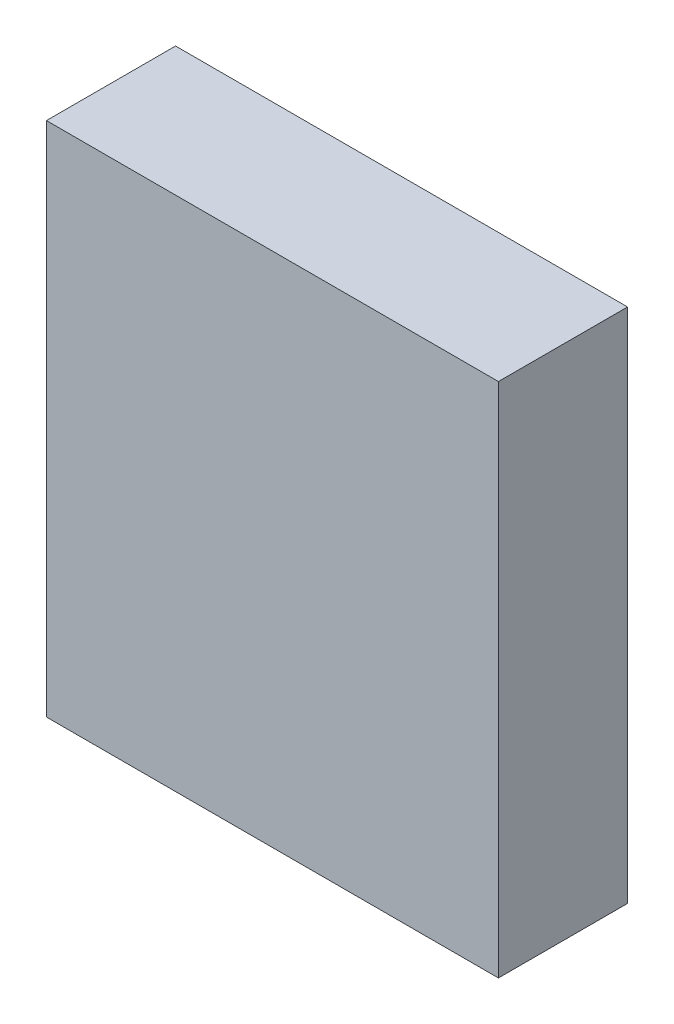
ISO-10303-21;
HEADER;
FILE_DESCRIPTION(('STEP AP214'),'2;1');
FILE_NAME('part.step','',(''),(''),'','','');
FILE_SCHEMA(('AUTOMOTIVE_DESIGN { 1 0 10303 214 1 1 1 1 }'));
ENDSEC;
DATA;
#1=APPLICATION_CONTEXT('core data for automotive mechanical design processes');
#2=APPLICATION_PROTOCOL_DEFINITION('international standard','automotive_design',2000,#1);
#3=PRODUCT_CONTEXT('',#1,'mechanical');
#4=PRODUCT('Part','Part','',(#3));
#5=PRODUCT_RELATED_PRODUCT_CATEGORY('part','',(#4));
#6=PRODUCT_DEFINITION_FORMATION('','',#4);
#7=PRODUCT_DEFINITION_CONTEXT('part definition',#1,'design');
#8=PRODUCT_DEFINITION('design','',#6,#7);
#9=PRODUCT_DEFINITION_SHAPE('','',#8);
#10=(LENGTH_UNIT() NAMED_UNIT(*) SI_UNIT(.MILLI.,.METRE.));
#11=(NAMED_UNIT(*) PLANE_ANGLE_UNIT() SI_UNIT($,.RADIAN.));
#12=(NAMED_UNIT(*) SI_UNIT($,.STERADIAN.) SOLID_ANGLE_UNIT());
#13=UNCERTAINTY_MEASURE_WITH_UNIT(LENGTH_MEASURE(1.E-05),#10,'distance_accuracy_value','');
#14=(GEOMETRIC_REPRESENTATION_CONTEXT(3) GLOBAL_UNCERTAINTY_ASSIGNED_CONTEXT((#13)) GLOBAL_UNIT_ASSIGNED_CONTEXT((#10,
#11,#12)) REPRESENTATION_CONTEXT('',''));
#15=CARTESIAN_POINT('',(0.,0.,0.));
#16=DIRECTION('',(0.,0.,1.));
#17=DIRECTION('',(1.,0.,0.));
#18=AXIS2_PLACEMENT_3D('',#15,#16,#17);
#19=CARTESIAN_POINT('',(0.,40.,0.));
#20=DIRECTION('',(1.,0.,0.));
#21=DIRECTION('',(0.,0.,-1.));
#22=AXIS2_PLACEMENT_3D('',#19,#20,#21);
#23=PLANE('',#22);
#24=DIRECTION('',(0.,0.,1.));
#25=VECTOR('',#24,1.);
#26=CARTESIAN_POINT('',(0.,0.,0.));
#27=LINE('',#26,#25);
#28=CARTESIAN_POINT('',(0.,0.,-10.));
#29=VERTEX_POINT('',#28);
#30=CARTESIAN_POINT('',(0.,0.,0.));
#31=VERTEX_POINT('',#30);
#32=EDGE_CURVE('E100',#29,#31,#27,.T.);
#33=ORIENTED_EDGE('',*,*,#32,.T.);
#34=DIRECTION('',(0.,-1.,0.));
#35=VECTOR('',#34,1.);
#36=CARTESIAN_POINT('',(0.,40.,0.));
#37=LINE('',#36,#35);
#38=CARTESIAN_POINT('',(0.,40.,0.));
#39=VERTEX_POINT('',#38);
#40=EDGE_CURVE('E11',#39,#31,#37,.T.);
#41=ORIENTED_EDGE('',*,*,#40,.F.);
#42=DIRECTION('',(0.,0.,1.));
#43=VECTOR('',#42,1.);
#44=CARTESIAN_POINT('',(0.,40.,0.));
#45=LINE('',#44,#43);
#46=CARTESIAN_POINT('',(0.,40.,-10.));
#47=VERTEX_POINT('',#46);
#48=EDGE_CURVE('E88',#47,#39,#45,.T.);
#49=ORIENTED_EDGE('',*,*,#48,.F.);
#50=DIRECTION('',(0.,-1.,0.));
#51=VECTOR('',#50,1.);
#52=CARTESIAN_POINT('',(0.,40.,-10.));
#53=LINE('',#52,#51);
#54=EDGE_CURVE('E96',#47,#29,#53,.T.);
#55=ORIENTED_EDGE('',*,*,#54,.T.);
#56=EDGE_LOOP('',(#33,#41,#49,#55));
#57=FACE_BOUND('',#56,.T.);
#58=ADVANCED_FACE('F37',(#57),#23,.F.);
#59=CARTESIAN_POINT('',(0.,40.,0.));
#60=DIRECTION('',(0.,0.,-1.));
#61=DIRECTION('',(-1.,0.,0.));
#62=AXIS2_PLACEMENT_3D('',#59,#60,#61);
#63=PLANE('',#62);
#64=DIRECTION('',(1.,0.,0.));
#65=VECTOR('',#64,1.);
#66=CARTESIAN_POINT('',(0.,0.,0.));
#67=LINE('',#66,#65);
#68=CARTESIAN_POINT('',(35.,0.,0.));
#69=VERTEX_POINT('',#68);
#70=EDGE_CURVE('E92',#31,#69,#67,.T.);
#71=ORIENTED_EDGE('',*,*,#70,.T.);
#72=DIRECTION('',(0.,-1.,0.));
#73=VECTOR('',#72,1.);
#74=CARTESIAN_POINT('',(35.,40.,0.));
#75=LINE('',#74,#73);
#76=CARTESIAN_POINT('',(35.,40.,0.));
#77=VERTEX_POINT('',#76);
#78=EDGE_CURVE('E45',#77,#69,#75,.T.);
#79=ORIENTED_EDGE('',*,*,#78,.F.);
#80=DIRECTION('',(1.,0.,0.));
#81=VECTOR('',#80,1.);
#82=CARTESIAN_POINT('',(0.,40.,0.));
#83=LINE('',#82,#81);
#84=EDGE_CURVE('E83',#39,#77,#83,.T.);
#85=ORIENTED_EDGE('',*,*,#84,.F.);
#86=ORIENTED_EDGE('',*,*,#40,.T.);
#87=EDGE_LOOP('',(#71,#79,#85,#86));
#88=FACE_BOUND('',#87,.T.);
#89=ADVANCED_FACE('F91',(#88),#63,.F.);
#90=CARTESIAN_POINT('',(35.,40.,0.));
#91=DIRECTION('',(-1.,0.,0.));
#92=DIRECTION('',(0.,0.,1.));
#93=AXIS2_PLACEMENT_3D('',#90,#91,#92);
#94=PLANE('',#93);
#95=DIRECTION('',(0.,0.,-1.));
#96=VECTOR('',#95,1.);
#97=CARTESIAN_POINT('',(35.,0.,0.));
#98=LINE('',#97,#96);
#99=CARTESIAN_POINT('',(35.,0.,-10.));
#100=VERTEX_POINT('',#99);
#101=EDGE_CURVE('E70',#69,#100,#98,.T.);
#102=ORIENTED_EDGE('',*,*,#101,.T.);
#103=DIRECTION('',(0.,-1.,0.));
#104=VECTOR('',#103,1.);
#105=CARTESIAN_POINT('',(35.,40.,-10.));
#106=LINE('',#105,#104);
#107=CARTESIAN_POINT('',(35.,40.,-10.));
#108=VERTEX_POINT('',#107);
#109=EDGE_CURVE('E93',#108,#100,#106,.T.);
#110=ORIENTED_EDGE('',*,*,#109,.F.);
#111=DIRECTION('',(0.,0.,-1.));
#112=VECTOR('',#111,1.);
#113=CARTESIAN_POINT('',(35.,40.,0.));
#114=LINE('',#113,#112);
#115=EDGE_CURVE('E86',#77,#108,#114,.T.);
#116=ORIENTED_EDGE('',*,*,#115,.F.);
#117=ORIENTED_EDGE('',*,*,#78,.T.);
#118=EDGE_LOOP('',(#102,#110,#116,#117));
#119=FACE_BOUND('',#118,.T.);
#120=ADVANCED_FACE('F94',(#119),#94,.F.);
#121=CARTESIAN_POINT('',(0.,40.,-10.));
#122=DIRECTION('',(0.,0.,1.));
#123=DIRECTION('',(1.,0.,0.));
#124=AXIS2_PLACEMENT_3D('',#121,#122,#123);
#125=PLANE('',#124);
#126=DIRECTION('',(-1.,0.,0.));
#127=VECTOR('',#126,1.);
#128=CARTESIAN_POINT('',(0.,0.,-10.));
#129=LINE('',#128,#127);
#130=EDGE_CURVE('E76',#100,#29,#129,.T.);
#131=ORIENTED_EDGE('',*,*,#130,.T.);
#132=ORIENTED_EDGE('',*,*,#54,.F.);
#133=DIRECTION('',(-1.,0.,0.));
#134=VECTOR('',#133,1.);
#135=CARTESIAN_POINT('',(0.,40.,-10.));
#136=LINE('',#135,#134);
#137=EDGE_CURVE('E53',#108,#47,#136,.T.);
#138=ORIENTED_EDGE('',*,*,#137,.F.);
#139=ORIENTED_EDGE('',*,*,#109,.T.);
#140=EDGE_LOOP('',(#131,#132,#138,#139));
#141=FACE_BOUND('',#140,.T.);
#142=ADVANCED_FACE('F107',(#141),#125,.F.);
#143=CARTESIAN_POINT('',(0.,40.,0.));
#144=DIRECTION('',(0.,-1.,0.));
#145=DIRECTION('',(0.,0.,-1.));
#146=AXIS2_PLACEMENT_3D('',#143,#144,#145);
#147=PLANE('',#146);
#148=ORIENTED_EDGE('',*,*,#48,.T.);
#149=ORIENTED_EDGE('',*,*,#84,.T.);
#150=ORIENTED_EDGE('',*,*,#115,.T.);
#151=ORIENTED_EDGE('',*,*,#137,.T.);
#152=EDGE_LOOP('',(#148,#149,#150,#151));
#153=FACE_BOUND('',#152,.T.);
#154=ADVANCED_FACE('F84',(#153),#147,.F.);
#155=CARTESIAN_POINT('',(0.,0.,0.));
#156=DIRECTION('',(0.,-1.,0.));
#157=DIRECTION('',(0.,0.,-1.));
#158=AXIS2_PLACEMENT_3D('',#155,#156,#157);
#159=PLANE('',#158);
#160=ORIENTED_EDGE('',*,*,#32,.F.);
#161=ORIENTED_EDGE('',*,*,#130,.F.);
#162=ORIENTED_EDGE('',*,*,#101,.F.);
#163=ORIENTED_EDGE('',*,*,#70,.F.);
#164=EDGE_LOOP('',(#160,#161,#162,#163));
#165=FACE_BOUND('',#164,.T.);
#166=ADVANCED_FACE('F110',(#165),#159,.T.);
#167=CLOSED_SHELL('',(#58,#89,#120,#142,#154,#166));
#168=MANIFOLD_SOLID_BREP('B2',#167);
#169=ADVANCED_BREP_SHAPE_REPRESENTATION('',(#18,#168),#14);
#170=SHAPE_DEFINITION_REPRESENTATION(#9,#169);
ENDSEC;
END-ISO-10303-21;
